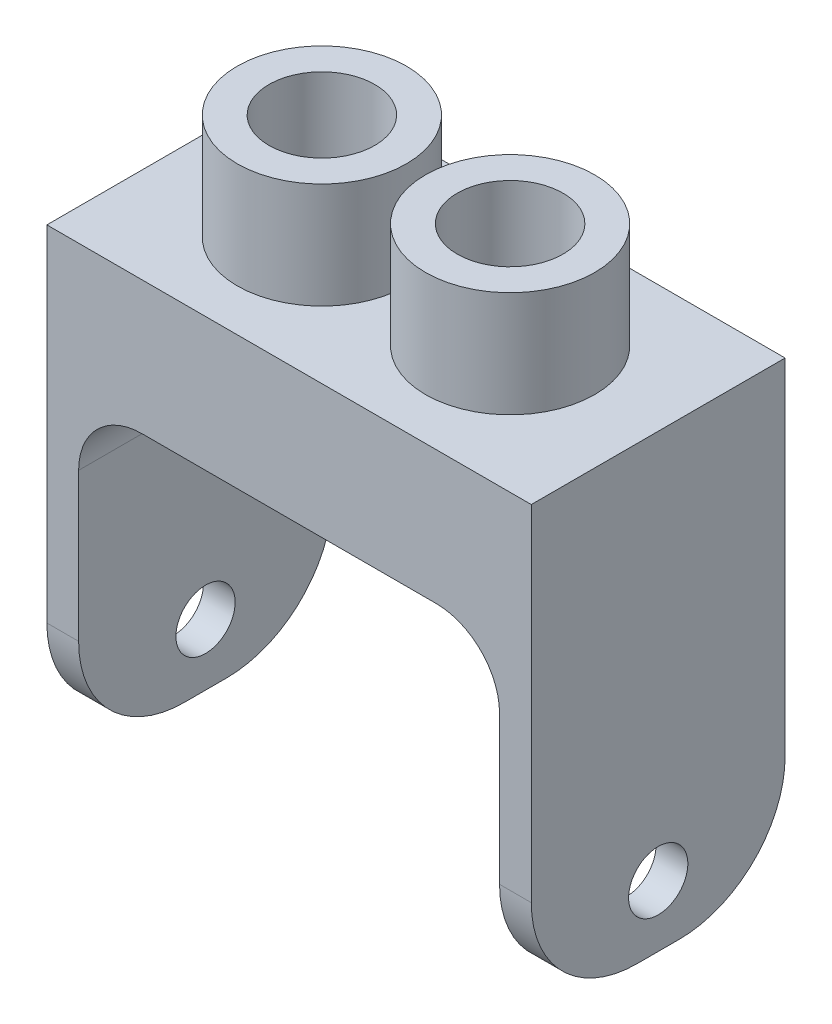
ISO-10303-21;
HEADER;
FILE_DESCRIPTION(('STEP AP214'),'2;1');
FILE_NAME('part.step','',(''),(''),'','','');
FILE_SCHEMA(('AUTOMOTIVE_DESIGN { 1 0 10303 214 1 1 1 1 }'));
ENDSEC;
DATA;
#1=APPLICATION_CONTEXT('core data for automotive mechanical design processes');
#2=APPLICATION_PROTOCOL_DEFINITION('international standard','automotive_design',2000,#1);
#3=PRODUCT_CONTEXT('',#1,'mechanical');
#4=PRODUCT('Part','Part','',(#3));
#5=PRODUCT_RELATED_PRODUCT_CATEGORY('part','',(#4));
#6=PRODUCT_DEFINITION_FORMATION('','',#4);
#7=PRODUCT_DEFINITION_CONTEXT('part definition',#1,'design');
#8=PRODUCT_DEFINITION('design','',#6,#7);
#9=PRODUCT_DEFINITION_SHAPE('','',#8);
#10=(LENGTH_UNIT() NAMED_UNIT(*) SI_UNIT(.MILLI.,.METRE.));
#11=(NAMED_UNIT(*) PLANE_ANGLE_UNIT() SI_UNIT($,.RADIAN.));
#12=(NAMED_UNIT(*) SI_UNIT($,.STERADIAN.) SOLID_ANGLE_UNIT());
#13=UNCERTAINTY_MEASURE_WITH_UNIT(LENGTH_MEASURE(1.E-05),#10,'distance_accuracy_value','');
#14=(GEOMETRIC_REPRESENTATION_CONTEXT(3) GLOBAL_UNCERTAINTY_ASSIGNED_CONTEXT((#13)) GLOBAL_UNIT_ASSIGNED_CONTEXT((#10,
#11,#12)) REPRESENTATION_CONTEXT('',''));
#15=CARTESIAN_POINT('',(0.,0.,0.));
#16=DIRECTION('',(0.,0.,1.));
#17=DIRECTION('',(1.,0.,0.));
#18=AXIS2_PLACEMENT_3D('',#15,#16,#17);
#19=CARTESIAN_POINT('',(0.,0.,0.));
#20=DIRECTION('',(0.,-1.,0.));
#21=DIRECTION('',(0.,0.,-1.));
#22=AXIS2_PLACEMENT_3D('',#19,#20,#21);
#23=PLANE('',#22);
#24=DIRECTION('',(-1.,0.,0.));
#25=VECTOR('',#24,1.);
#26=CARTESIAN_POINT('',(-11.45,0.,-6.));
#27=LINE('',#26,#25);
#28=CARTESIAN_POINT('',(6.95,0.,-6.));
#29=VERTEX_POINT('',#28);
#30=CARTESIAN_POINT('',(-6.95,0.,-6.));
#31=VERTEX_POINT('',#30);
#32=EDGE_CURVE('E269',#29,#31,#27,.T.);
#33=ORIENTED_EDGE('',*,*,#32,.F.);
#34=DIRECTION('',(0.,0.,-1.));
#35=VECTOR('',#34,1.);
#36=CARTESIAN_POINT('',(6.95,0.,0.));
#37=LINE('',#36,#35);
#38=CARTESIAN_POINT('',(6.95,0.,0.));
#39=VERTEX_POINT('',#38);
#40=EDGE_CURVE('E287',#29,#39,#37,.F.);
#41=ORIENTED_EDGE('',*,*,#40,.T.);
#42=CARTESIAN_POINT('',(4.45,0.,0.));
#43=DIRECTION('',(0.,-1.,0.));
#44=DIRECTION('',(0.,0.,-1.));
#45=AXIS2_PLACEMENT_3D('',#42,#43,#44);
#46=CIRCLE('',#45,2.5);
#47=EDGE_CURVE('E255',#39,#39,#46,.F.);
#48=ORIENTED_EDGE('',*,*,#47,.T.);
#49=DIRECTION('',(0.,0.,-1.));
#50=VECTOR('',#49,1.);
#51=CARTESIAN_POINT('',(6.95,0.,0.));
#52=LINE('',#51,#50);
#53=CARTESIAN_POINT('',(6.95,0.,6.));
#54=VERTEX_POINT('',#53);
#55=EDGE_CURVE('E285',#39,#54,#52,.F.);
#56=ORIENTED_EDGE('',*,*,#55,.T.);
#57=DIRECTION('',(1.,0.,0.));
#58=VECTOR('',#57,1.);
#59=CARTESIAN_POINT('',(-11.45,0.,6.));
#60=LINE('',#59,#58);
#61=CARTESIAN_POINT('',(-6.95,0.,6.));
#62=VERTEX_POINT('',#61);
#63=EDGE_CURVE('E164',#62,#54,#60,.T.);
#64=ORIENTED_EDGE('',*,*,#63,.F.);
#65=DIRECTION('',(0.,0.,1.));
#66=VECTOR('',#65,1.);
#67=CARTESIAN_POINT('',(-6.95,0.,0.));
#68=LINE('',#67,#66);
#69=CARTESIAN_POINT('',(-6.95,0.,0.));
#70=VERTEX_POINT('',#69);
#71=EDGE_CURVE('E283',#62,#70,#68,.F.);
#72=ORIENTED_EDGE('',*,*,#71,.T.);
#73=CARTESIAN_POINT('',(-4.45,0.,0.));
#74=DIRECTION('',(0.,-1.,0.));
#75=DIRECTION('',(0.,0.,-1.));
#76=AXIS2_PLACEMENT_3D('',#73,#74,#75);
#77=CIRCLE('',#76,2.5);
#78=EDGE_CURVE('E261',#70,#70,#77,.F.);
#79=ORIENTED_EDGE('',*,*,#78,.T.);
#80=DIRECTION('',(0.,0.,1.));
#81=VECTOR('',#80,1.);
#82=CARTESIAN_POINT('',(-6.95,0.,0.));
#83=LINE('',#82,#81);
#84=EDGE_CURVE('E281',#70,#31,#83,.F.);
#85=ORIENTED_EDGE('',*,*,#84,.T.);
#86=EDGE_LOOP('',(#33,#41,#48,#56,#64,#72,#79,#85));
#87=FACE_BOUND('',#86,.T.);
#88=ADVANCED_FACE('F35',(#87),#23,.T.);
#89=CARTESIAN_POINT('',(0.,6.3,0.));
#90=DIRECTION('',(0.,-1.,0.));
#91=DIRECTION('',(0.,0.,-1.));
#92=AXIS2_PLACEMENT_3D('',#89,#90,#91);
#93=PLANE('',#92);
#94=CARTESIAN_POINT('',(-4.45,6.3,0.));
#95=DIRECTION('',(0.,-1.,0.));
#96=DIRECTION('',(0.,0.,-1.));
#97=AXIS2_PLACEMENT_3D('',#94,#95,#96);
#98=CIRCLE('',#97,4.);
#99=CARTESIAN_POINT('',(-4.45,6.3,-4.));
#100=VERTEX_POINT('',#99);
#101=EDGE_CURVE('E169',#100,#100,#98,.F.);
#102=ORIENTED_EDGE('',*,*,#101,.F.);
#103=EDGE_LOOP('',(#102));
#104=FACE_BOUND('',#103,.T.);
#105=DIRECTION('',(0.,0.,-1.));
#106=VECTOR('',#105,1.);
#107=CARTESIAN_POINT('',(11.45,6.3,6.));
#108=LINE('',#107,#106);
#109=CARTESIAN_POINT('',(11.45,6.3,6.));
#110=VERTEX_POINT('',#109);
#111=CARTESIAN_POINT('',(11.45,6.3,-6.));
#112=VERTEX_POINT('',#111);
#113=EDGE_CURVE('E154',#110,#112,#108,.T.);
#114=ORIENTED_EDGE('',*,*,#113,.T.);
#115=DIRECTION('',(-1.,0.,0.));
#116=VECTOR('',#115,1.);
#117=CARTESIAN_POINT('',(-11.45,6.3,-6.));
#118=LINE('',#117,#116);
#119=CARTESIAN_POINT('',(-11.45,6.3,-6.));
#120=VERTEX_POINT('',#119);
#121=EDGE_CURVE('E142',#112,#120,#118,.T.);
#122=ORIENTED_EDGE('',*,*,#121,.T.);
#123=DIRECTION('',(0.,0.,1.));
#124=VECTOR('',#123,1.);
#125=CARTESIAN_POINT('',(-11.45,6.3,6.));
#126=LINE('',#125,#124);
#127=CARTESIAN_POINT('',(-11.45,6.3,6.));
#128=VERTEX_POINT('',#127);
#129=EDGE_CURVE('E153',#120,#128,#126,.T.);
#130=ORIENTED_EDGE('',*,*,#129,.T.);
#131=DIRECTION('',(1.,0.,0.));
#132=VECTOR('',#131,1.);
#133=CARTESIAN_POINT('',(-11.45,6.3,6.));
#134=LINE('',#133,#132);
#135=EDGE_CURVE('E160',#128,#110,#134,.T.);
#136=ORIENTED_EDGE('',*,*,#135,.T.);
#137=EDGE_LOOP('',(#114,#122,#130,#136));
#138=FACE_BOUND('',#137,.T.);
#139=CARTESIAN_POINT('',(4.45,6.3,0.));
#140=DIRECTION('',(0.,-1.,0.));
#141=DIRECTION('',(0.,0.,-1.));
#142=AXIS2_PLACEMENT_3D('',#139,#140,#141);
#143=CIRCLE('',#142,4.);
#144=CARTESIAN_POINT('',(4.45,6.3,-4.));
#145=VERTEX_POINT('',#144);
#146=EDGE_CURVE('E172',#145,#145,#143,.F.);
#147=ORIENTED_EDGE('',*,*,#146,.F.);
#148=EDGE_LOOP('',(#147));
#149=FACE_BOUND('',#148,.T.);
#150=ADVANCED_FACE('F157',(#104,#138,#149),#93,.F.);
#151=CARTESIAN_POINT('',(11.45,6.3,6.));
#152=DIRECTION('',(-1.,0.,0.));
#153=DIRECTION('',(0.,0.,1.));
#154=AXIS2_PLACEMENT_3D('',#151,#152,#153);
#155=PLANE('',#154);
#156=CARTESIAN_POINT('',(11.45,-12.1,0.));
#157=DIRECTION('',(-1.,0.,0.));
#158=DIRECTION('',(0.,0.,1.));
#159=AXIS2_PLACEMENT_3D('',#156,#157,#158);
#160=CIRCLE('',#159,1.4);
#161=CARTESIAN_POINT('',(11.45,-12.1,1.4));
#162=VERTEX_POINT('',#161);
#163=EDGE_CURVE('E303',#162,#162,#160,.F.);
#164=ORIENTED_EDGE('',*,*,#163,.F.);
#165=EDGE_LOOP('',(#164));
#166=FACE_BOUND('',#165,.T.);
#167=DIRECTION('',(0.,0.,1.));
#168=VECTOR('',#167,1.);
#169=CARTESIAN_POINT('',(11.45,-15.,6.));
#170=LINE('',#169,#168);
#171=CARTESIAN_POINT('',(11.45,-15.,-1.));
#172=VERTEX_POINT('',#171);
#173=CARTESIAN_POINT('',(11.45,-15.,1.));
#174=VERTEX_POINT('',#173);
#175=EDGE_CURVE('E234',#172,#174,#170,.T.);
#176=ORIENTED_EDGE('',*,*,#175,.F.);
#177=CARTESIAN_POINT('',(11.45,-10.,-1.));
#178=DIRECTION('',(-1.,0.,0.));
#179=DIRECTION('',(0.,0.,1.));
#180=AXIS2_PLACEMENT_3D('',#177,#178,#179);
#181=CIRCLE('',#180,5.);
#182=CARTESIAN_POINT('',(11.45,-10.,-6.));
#183=VERTEX_POINT('',#182);
#184=EDGE_CURVE('E168',#172,#183,#181,.F.);
#185=ORIENTED_EDGE('',*,*,#184,.T.);
#186=DIRECTION('',(0.,-1.,0.));
#187=VECTOR('',#186,1.);
#188=CARTESIAN_POINT('',(11.45,6.3,-6.));
#189=LINE('',#188,#187);
#190=EDGE_CURVE('E147',#112,#183,#189,.T.);
#191=ORIENTED_EDGE('',*,*,#190,.F.);
#192=ORIENTED_EDGE('',*,*,#113,.F.);
#193=DIRECTION('',(0.,-1.,0.));
#194=VECTOR('',#193,1.);
#195=CARTESIAN_POINT('',(11.45,6.3,6.));
#196=LINE('',#195,#194);
#197=CARTESIAN_POINT('',(11.45,-10.,6.));
#198=VERTEX_POINT('',#197);
#199=EDGE_CURVE('E235',#110,#198,#196,.T.);
#200=ORIENTED_EDGE('',*,*,#199,.T.);
#201=CARTESIAN_POINT('',(11.45,-10.,1.));
#202=DIRECTION('',(-1.,0.,0.));
#203=DIRECTION('',(0.,0.,1.));
#204=AXIS2_PLACEMENT_3D('',#201,#202,#203);
#205=CIRCLE('',#204,5.);
#206=EDGE_CURVE('E214',#198,#174,#205,.F.);
#207=ORIENTED_EDGE('',*,*,#206,.T.);
#208=EDGE_LOOP('',(#176,#185,#191,#192,#200,#207));
#209=FACE_BOUND('',#208,.T.);
#210=ADVANCED_FACE('F167',(#166,#209),#155,.F.);
#211=CARTESIAN_POINT('',(-11.45,6.3,-6.));
#212=DIRECTION('',(0.,0.,1.));
#213=DIRECTION('',(1.,0.,0.));
#214=AXIS2_PLACEMENT_3D('',#211,#212,#213);
#215=PLANE('',#214);
#216=DIRECTION('',(0.,1.,0.));
#217=VECTOR('',#216,1.);
#218=CARTESIAN_POINT('',(-9.95,-15.,-6.));
#219=LINE('',#218,#217);
#220=CARTESIAN_POINT('',(-9.95,-10.,-6.));
#221=VERTEX_POINT('',#220);
#222=CARTESIAN_POINT('',(-9.95,-3.,-6.));
#223=VERTEX_POINT('',#222);
#224=EDGE_CURVE('E189',#221,#223,#219,.T.);
#225=ORIENTED_EDGE('',*,*,#224,.F.);
#226=DIRECTION('',(1.,0.,0.));
#227=VECTOR('',#226,1.);
#228=CARTESIAN_POINT('',(-11.45,-10.,-6.));
#229=LINE('',#228,#227);
#230=CARTESIAN_POINT('',(-11.45,-10.,-6.));
#231=VERTEX_POINT('',#230);
#232=EDGE_CURVE('E199',#221,#231,#229,.F.);
#233=ORIENTED_EDGE('',*,*,#232,.T.);
#234=DIRECTION('',(0.,-1.,0.));
#235=VECTOR('',#234,1.);
#236=CARTESIAN_POINT('',(-11.45,6.3,-6.));
#237=LINE('',#236,#235);
#238=EDGE_CURVE('E150',#120,#231,#237,.T.);
#239=ORIENTED_EDGE('',*,*,#238,.F.);
#240=ORIENTED_EDGE('',*,*,#121,.F.);
#241=ORIENTED_EDGE('',*,*,#190,.T.);
#242=DIRECTION('',(1.,0.,0.));
#243=VECTOR('',#242,1.);
#244=CARTESIAN_POINT('',(-11.45,-10.,-6.));
#245=LINE('',#244,#243);
#246=CARTESIAN_POINT('',(9.95,-10.,-6.));
#247=VERTEX_POINT('',#246);
#248=EDGE_CURVE('E197',#183,#247,#245,.F.);
#249=ORIENTED_EDGE('',*,*,#248,.T.);
#250=DIRECTION('',(0.,1.,0.));
#251=VECTOR('',#250,1.);
#252=CARTESIAN_POINT('',(9.95,-15.,-6.));
#253=LINE('',#252,#251);
#254=CARTESIAN_POINT('',(9.95,-3.,-6.));
#255=VERTEX_POINT('',#254);
#256=EDGE_CURVE('E230',#247,#255,#253,.T.);
#257=ORIENTED_EDGE('',*,*,#256,.T.);
#258=CARTESIAN_POINT('',(6.95,-3.,-6.));
#259=DIRECTION('',(0.,0.,1.));
#260=DIRECTION('',(1.,0.,0.));
#261=AXIS2_PLACEMENT_3D('',#258,#259,#260);
#262=CIRCLE('',#261,3.);
#263=EDGE_CURVE('E292',#255,#29,#262,.T.);
#264=ORIENTED_EDGE('',*,*,#263,.T.);
#265=ORIENTED_EDGE('',*,*,#32,.T.);
#266=CARTESIAN_POINT('',(-6.95,-3.,-6.));
#267=DIRECTION('',(0.,0.,1.));
#268=DIRECTION('',(1.,0.,0.));
#269=AXIS2_PLACEMENT_3D('',#266,#267,#268);
#270=CIRCLE('',#269,3.);
#271=EDGE_CURVE('E297',#31,#223,#270,.T.);
#272=ORIENTED_EDGE('',*,*,#271,.T.);
#273=EDGE_LOOP('',(#225,#233,#239,#240,#241,#249,#257,#264,#265,#272));
#274=FACE_BOUND('',#273,.T.);
#275=ADVANCED_FACE('F145',(#274),#215,.F.);
#276=CARTESIAN_POINT('',(-11.45,6.3,6.));
#277=DIRECTION('',(1.,0.,0.));
#278=DIRECTION('',(0.,0.,-1.));
#279=AXIS2_PLACEMENT_3D('',#276,#277,#278);
#280=PLANE('',#279);
#281=CARTESIAN_POINT('',(-11.45,-12.1,0.));
#282=DIRECTION('',(-1.,0.,0.));
#283=DIRECTION('',(0.,0.,1.));
#284=AXIS2_PLACEMENT_3D('',#281,#282,#283);
#285=CIRCLE('',#284,1.4);
#286=CARTESIAN_POINT('',(-11.45,-12.1,1.4));
#287=VERTEX_POINT('',#286);
#288=EDGE_CURVE('E591',#287,#287,#285,.T.);
#289=ORIENTED_EDGE('',*,*,#288,.F.);
#290=EDGE_LOOP('',(#289));
#291=FACE_BOUND('',#290,.T.);
#292=ORIENTED_EDGE('',*,*,#238,.T.);
#293=CARTESIAN_POINT('',(-11.45,-10.,-1.));
#294=DIRECTION('',(1.,0.,0.));
#295=DIRECTION('',(0.,0.,-1.));
#296=AXIS2_PLACEMENT_3D('',#293,#294,#295);
#297=CIRCLE('',#296,5.);
#298=CARTESIAN_POINT('',(-11.45,-15.,-1.));
#299=VERTEX_POINT('',#298);
#300=EDGE_CURVE('E203',#231,#299,#297,.F.);
#301=ORIENTED_EDGE('',*,*,#300,.T.);
#302=DIRECTION('',(0.,0.,-1.));
#303=VECTOR('',#302,1.);
#304=CARTESIAN_POINT('',(-11.45,-15.,6.));
#305=LINE('',#304,#303);
#306=CARTESIAN_POINT('',(-11.45,-15.,1.));
#307=VERTEX_POINT('',#306);
#308=EDGE_CURVE('E229',#307,#299,#305,.T.);
#309=ORIENTED_EDGE('',*,*,#308,.F.);
#310=CARTESIAN_POINT('',(-11.45,-10.,1.));
#311=DIRECTION('',(1.,0.,0.));
#312=DIRECTION('',(0.,0.,-1.));
#313=AXIS2_PLACEMENT_3D('',#310,#311,#312);
#314=CIRCLE('',#313,5.);
#315=CARTESIAN_POINT('',(-11.45,-10.,6.));
#316=VERTEX_POINT('',#315);
#317=EDGE_CURVE('E201',#307,#316,#314,.F.);
#318=ORIENTED_EDGE('',*,*,#317,.T.);
#319=DIRECTION('',(0.,-1.,0.));
#320=VECTOR('',#319,1.);
#321=CARTESIAN_POINT('',(-11.45,6.3,6.));
#322=LINE('',#321,#320);
#323=EDGE_CURVE('E174',#128,#316,#322,.T.);
#324=ORIENTED_EDGE('',*,*,#323,.F.);
#325=ORIENTED_EDGE('',*,*,#129,.F.);
#326=EDGE_LOOP('',(#292,#301,#309,#318,#324,#325));
#327=FACE_BOUND('',#326,.T.);
#328=ADVANCED_FACE('F322',(#291,#327),#280,.F.);
#329=CARTESIAN_POINT('',(-11.45,6.3,6.));
#330=DIRECTION('',(0.,0.,-1.));
#331=DIRECTION('',(-1.,0.,0.));
#332=AXIS2_PLACEMENT_3D('',#329,#330,#331);
#333=PLANE('',#332);
#334=ORIENTED_EDGE('',*,*,#323,.T.);
#335=DIRECTION('',(-1.,0.,0.));
#336=VECTOR('',#335,1.);
#337=CARTESIAN_POINT('',(-9.95,-10.,6.));
#338=LINE('',#337,#336);
#339=CARTESIAN_POINT('',(-9.95,-10.,6.));
#340=VERTEX_POINT('',#339);
#341=EDGE_CURVE('E207',#316,#340,#338,.F.);
#342=ORIENTED_EDGE('',*,*,#341,.T.);
#343=DIRECTION('',(0.,1.,0.));
#344=VECTOR('',#343,1.);
#345=CARTESIAN_POINT('',(-9.95,-15.,6.));
#346=LINE('',#345,#344);
#347=CARTESIAN_POINT('',(-9.95,-3.,6.));
#348=VERTEX_POINT('',#347);
#349=EDGE_CURVE('E186',#340,#348,#346,.T.);
#350=ORIENTED_EDGE('',*,*,#349,.T.);
#351=CARTESIAN_POINT('',(-6.95,-3.,6.));
#352=DIRECTION('',(0.,0.,-1.));
#353=DIRECTION('',(-1.,0.,0.));
#354=AXIS2_PLACEMENT_3D('',#351,#352,#353);
#355=CIRCLE('',#354,3.);
#356=EDGE_CURVE('E295',#348,#62,#355,.T.);
#357=ORIENTED_EDGE('',*,*,#356,.T.);
#358=ORIENTED_EDGE('',*,*,#63,.T.);
#359=CARTESIAN_POINT('',(6.95,-3.,6.));
#360=DIRECTION('',(0.,0.,-1.));
#361=DIRECTION('',(-1.,0.,0.));
#362=AXIS2_PLACEMENT_3D('',#359,#360,#361);
#363=CIRCLE('',#362,3.);
#364=CARTESIAN_POINT('',(9.95,-3.,6.));
#365=VERTEX_POINT('',#364);
#366=EDGE_CURVE('E227',#54,#365,#363,.T.);
#367=ORIENTED_EDGE('',*,*,#366,.T.);
#368=DIRECTION('',(0.,1.,0.));
#369=VECTOR('',#368,1.);
#370=CARTESIAN_POINT('',(9.95,-15.,6.));
#371=LINE('',#370,#369);
#372=CARTESIAN_POINT('',(9.95,-10.,6.));
#373=VERTEX_POINT('',#372);
#374=EDGE_CURVE('E219',#373,#365,#371,.T.);
#375=ORIENTED_EDGE('',*,*,#374,.F.);
#376=DIRECTION('',(-1.,0.,0.));
#377=VECTOR('',#376,1.);
#378=CARTESIAN_POINT('',(-11.45,-10.,6.));
#379=LINE('',#378,#377);
#380=EDGE_CURVE('E205',#373,#198,#379,.F.);
#381=ORIENTED_EDGE('',*,*,#380,.T.);
#382=ORIENTED_EDGE('',*,*,#199,.F.);
#383=ORIENTED_EDGE('',*,*,#135,.F.);
#384=EDGE_LOOP('',(#334,#342,#350,#357,#358,#367,#375,#381,#382,#383));
#385=FACE_BOUND('',#384,.T.);
#386=ADVANCED_FACE('F224',(#385),#333,.F.);
#387=CARTESIAN_POINT('',(-4.45,11.3,0.));
#388=DIRECTION('',(0.,-1.,0.));
#389=DIRECTION('',(0.,0.,-1.));
#390=AXIS2_PLACEMENT_3D('',#387,#388,#389);
#391=CYLINDRICAL_SURFACE('',#390,4.);
#392=CARTESIAN_POINT('',(-4.45,11.3,0.));
#393=DIRECTION('',(0.,1.,0.));
#394=DIRECTION('',(0.,0.,1.));
#395=AXIS2_PLACEMENT_3D('',#392,#393,#394);
#396=CIRCLE('',#395,4.);
#397=CARTESIAN_POINT('',(-4.45,11.3,4.));
#398=VERTEX_POINT('',#397);
#399=EDGE_CURVE('E267',#398,#398,#396,.T.);
#400=ORIENTED_EDGE('',*,*,#399,.F.);
#401=EDGE_LOOP('',(#400));
#402=FACE_BOUND('',#401,.T.);
#403=ORIENTED_EDGE('',*,*,#101,.T.);
#404=EDGE_LOOP('',(#403));
#405=FACE_BOUND('',#404,.T.);
#406=ADVANCED_FACE('F361',(#402,#405),#391,.T.);
#407=CARTESIAN_POINT('',(-4.45,11.3,0.));
#408=DIRECTION('',(0.,1.,0.));
#409=DIRECTION('',(0.,0.,1.));
#410=AXIS2_PLACEMENT_3D('',#407,#408,#409);
#411=PLANE('',#410);
#412=CARTESIAN_POINT('',(-4.45,11.3,0.));
#413=DIRECTION('',(0.,1.,0.));
#414=DIRECTION('',(0.,0.,1.));
#415=AXIS2_PLACEMENT_3D('',#412,#413,#414);
#416=CIRCLE('',#415,2.5);
#417=CARTESIAN_POINT('',(-4.45,11.3,2.5));
#418=VERTEX_POINT('',#417);
#419=EDGE_CURVE('E258',#418,#418,#416,.T.);
#420=ORIENTED_EDGE('',*,*,#419,.F.);
#421=EDGE_LOOP('',(#420));
#422=FACE_BOUND('',#421,.T.);
#423=ORIENTED_EDGE('',*,*,#399,.T.);
#424=EDGE_LOOP('',(#423));
#425=FACE_BOUND('',#424,.T.);
#426=ADVANCED_FACE('F414',(#422,#425),#411,.T.);
#427=CARTESIAN_POINT('',(4.45,11.3,0.));
#428=DIRECTION('',(0.,-1.,0.));
#429=DIRECTION('',(0.,0.,-1.));
#430=AXIS2_PLACEMENT_3D('',#427,#428,#429);
#431=CYLINDRICAL_SURFACE('',#430,4.);
#432=CARTESIAN_POINT('',(4.45,11.3,0.));
#433=DIRECTION('',(0.,1.,0.));
#434=DIRECTION('',(0.,0.,1.));
#435=AXIS2_PLACEMENT_3D('',#432,#433,#434);
#436=CIRCLE('',#435,4.);
#437=CARTESIAN_POINT('',(4.45,11.3,4.));
#438=VERTEX_POINT('',#437);
#439=EDGE_CURVE('E264',#438,#438,#436,.T.);
#440=ORIENTED_EDGE('',*,*,#439,.F.);
#441=EDGE_LOOP('',(#440));
#442=FACE_BOUND('',#441,.T.);
#443=ORIENTED_EDGE('',*,*,#146,.T.);
#444=EDGE_LOOP('',(#443));
#445=FACE_BOUND('',#444,.T.);
#446=ADVANCED_FACE('F410',(#442,#445),#431,.T.);
#447=CARTESIAN_POINT('',(4.45,11.3,0.));
#448=DIRECTION('',(0.,1.,0.));
#449=DIRECTION('',(0.,0.,1.));
#450=AXIS2_PLACEMENT_3D('',#447,#448,#449);
#451=PLANE('',#450);
#452=CARTESIAN_POINT('',(4.45,11.3,0.));
#453=DIRECTION('',(0.,1.,0.));
#454=DIRECTION('',(0.,0.,1.));
#455=AXIS2_PLACEMENT_3D('',#452,#453,#454);
#456=CIRCLE('',#455,2.5);
#457=CARTESIAN_POINT('',(4.45,11.3,2.5));
#458=VERTEX_POINT('',#457);
#459=EDGE_CURVE('E252',#458,#458,#456,.T.);
#460=ORIENTED_EDGE('',*,*,#459,.F.);
#461=EDGE_LOOP('',(#460));
#462=FACE_BOUND('',#461,.T.);
#463=ORIENTED_EDGE('',*,*,#439,.T.);
#464=EDGE_LOOP('',(#463));
#465=FACE_BOUND('',#464,.T.);
#466=ADVANCED_FACE('F406',(#462,#465),#451,.T.);
#467=CARTESIAN_POINT('',(-4.45,-7.07106781186548,0.));
#468=DIRECTION('',(0.,1.,0.));
#469=DIRECTION('',(0.,0.,1.));
#470=AXIS2_PLACEMENT_3D('',#467,#468,#469);
#471=CYLINDRICAL_SURFACE('',#470,2.5);
#472=ORIENTED_EDGE('',*,*,#419,.T.);
#473=EDGE_LOOP('',(#472));
#474=FACE_BOUND('',#473,.T.);
#475=ORIENTED_EDGE('',*,*,#78,.F.);
#476=EDGE_LOOP('',(#475));
#477=FACE_BOUND('',#476,.T.);
#478=ADVANCED_FACE('F402',(#474,#477),#471,.F.);
#479=CARTESIAN_POINT('',(4.45,-7.07106781186548,0.));
#480=DIRECTION('',(0.,1.,0.));
#481=DIRECTION('',(0.,0.,1.));
#482=AXIS2_PLACEMENT_3D('',#479,#480,#481);
#483=CYLINDRICAL_SURFACE('',#482,2.5);
#484=ORIENTED_EDGE('',*,*,#459,.T.);
#485=EDGE_LOOP('',(#484));
#486=FACE_BOUND('',#485,.T.);
#487=ORIENTED_EDGE('',*,*,#47,.F.);
#488=EDGE_LOOP('',(#487));
#489=FACE_BOUND('',#488,.T.);
#490=ADVANCED_FACE('F398',(#486,#489),#483,.F.);
#491=CARTESIAN_POINT('',(-9.95,-15.,6.));
#492=DIRECTION('',(-1.,0.,0.));
#493=DIRECTION('',(0.,0.,1.));
#494=AXIS2_PLACEMENT_3D('',#491,#492,#493);
#495=PLANE('',#494);
#496=CARTESIAN_POINT('',(-9.95,-12.1,0.));
#497=DIRECTION('',(-1.,0.,0.));
#498=DIRECTION('',(0.,0.,1.));
#499=AXIS2_PLACEMENT_3D('',#496,#497,#498);
#500=CIRCLE('',#499,1.4);
#501=CARTESIAN_POINT('',(-9.95,-12.1,1.4));
#502=VERTEX_POINT('',#501);
#503=EDGE_CURVE('E239',#502,#502,#500,.T.);
#504=ORIENTED_EDGE('',*,*,#503,.T.);
#505=EDGE_LOOP('',(#504));
#506=FACE_BOUND('',#505,.T.);
#507=DIRECTION('',(0.,0.,1.));
#508=VECTOR('',#507,1.);
#509=CARTESIAN_POINT('',(-9.95,-15.,6.));
#510=LINE('',#509,#508);
#511=CARTESIAN_POINT('',(-9.95,-15.,-1.));
#512=VERTEX_POINT('',#511);
#513=CARTESIAN_POINT('',(-9.95,-15.,1.));
#514=VERTEX_POINT('',#513);
#515=EDGE_CURVE('E190',#512,#514,#510,.T.);
#516=ORIENTED_EDGE('',*,*,#515,.F.);
#517=CARTESIAN_POINT('',(-9.95,-10.,-1.));
#518=DIRECTION('',(-1.,0.,0.));
#519=DIRECTION('',(0.,0.,1.));
#520=AXIS2_PLACEMENT_3D('',#517,#518,#519);
#521=CIRCLE('',#520,5.);
#522=EDGE_CURVE('E194',#512,#221,#521,.F.);
#523=ORIENTED_EDGE('',*,*,#522,.T.);
#524=ORIENTED_EDGE('',*,*,#224,.T.);
#525=DIRECTION('',(0.,0.,1.));
#526=VECTOR('',#525,1.);
#527=CARTESIAN_POINT('',(-9.95,-3.,6.));
#528=LINE('',#527,#526);
#529=EDGE_CURVE('E289',#223,#348,#528,.T.);
#530=ORIENTED_EDGE('',*,*,#529,.T.);
#531=ORIENTED_EDGE('',*,*,#349,.F.);
#532=CARTESIAN_POINT('',(-9.95,-10.,1.));
#533=DIRECTION('',(-1.,0.,0.));
#534=DIRECTION('',(0.,0.,1.));
#535=AXIS2_PLACEMENT_3D('',#532,#533,#534);
#536=CIRCLE('',#535,5.);
#537=EDGE_CURVE('E192',#340,#514,#536,.F.);
#538=ORIENTED_EDGE('',*,*,#537,.T.);
#539=EDGE_LOOP('',(#516,#523,#524,#530,#531,#538));
#540=FACE_BOUND('',#539,.T.);
#541=ADVANCED_FACE('F315',(#506,#540),#495,.F.);
#542=CARTESIAN_POINT('',(0.,-15.,0.));
#543=DIRECTION('',(0.,-1.,0.));
#544=DIRECTION('',(0.,0.,-1.));
#545=AXIS2_PLACEMENT_3D('',#542,#543,#544);
#546=PLANE('',#545);
#547=ORIENTED_EDGE('',*,*,#308,.T.);
#548=DIRECTION('',(1.,0.,0.));
#549=VECTOR('',#548,1.);
#550=CARTESIAN_POINT('',(-9.95,-15.,-1.));
#551=LINE('',#550,#549);
#552=EDGE_CURVE('E195',#299,#512,#551,.T.);
#553=ORIENTED_EDGE('',*,*,#552,.T.);
#554=ORIENTED_EDGE('',*,*,#515,.T.);
#555=DIRECTION('',(-1.,0.,0.));
#556=VECTOR('',#555,1.);
#557=CARTESIAN_POINT('',(-11.45,-15.,1.));
#558=LINE('',#557,#556);
#559=EDGE_CURVE('E300',#514,#307,#558,.T.);
#560=ORIENTED_EDGE('',*,*,#559,.T.);
#561=EDGE_LOOP('',(#547,#553,#554,#560));
#562=FACE_BOUND('',#561,.T.);
#563=ADVANCED_FACE('F309',(#562),#546,.T.);
#564=CARTESIAN_POINT('',(9.95,-15.,6.));
#565=DIRECTION('',(1.,0.,0.));
#566=DIRECTION('',(0.,0.,-1.));
#567=AXIS2_PLACEMENT_3D('',#564,#565,#566);
#568=PLANE('',#567);
#569=CARTESIAN_POINT('',(9.95,-12.1,0.));
#570=DIRECTION('',(1.,0.,0.));
#571=DIRECTION('',(0.,0.,-1.));
#572=AXIS2_PLACEMENT_3D('',#569,#570,#571);
#573=CIRCLE('',#572,1.4);
#574=CARTESIAN_POINT('',(9.95,-12.1,1.4));
#575=VERTEX_POINT('',#574);
#576=EDGE_CURVE('E243',#575,#575,#573,.T.);
#577=ORIENTED_EDGE('',*,*,#576,.T.);
#578=EDGE_LOOP('',(#577));
#579=FACE_BOUND('',#578,.T.);
#580=ORIENTED_EDGE('',*,*,#256,.F.);
#581=CARTESIAN_POINT('',(9.95,-10.,-1.));
#582=DIRECTION('',(1.,0.,0.));
#583=DIRECTION('',(0.,0.,-1.));
#584=AXIS2_PLACEMENT_3D('',#581,#582,#583);
#585=CIRCLE('',#584,5.);
#586=CARTESIAN_POINT('',(9.95,-15.,-1.));
#587=VERTEX_POINT('',#586);
#588=EDGE_CURVE('E11',#247,#587,#585,.F.);
#589=ORIENTED_EDGE('',*,*,#588,.T.);
#590=DIRECTION('',(0.,0.,-1.));
#591=VECTOR('',#590,1.);
#592=CARTESIAN_POINT('',(9.95,-15.,6.));
#593=LINE('',#592,#591);
#594=CARTESIAN_POINT('',(9.95,-15.,1.));
#595=VERTEX_POINT('',#594);
#596=EDGE_CURVE('E221',#595,#587,#593,.T.);
#597=ORIENTED_EDGE('',*,*,#596,.F.);
#598=CARTESIAN_POINT('',(9.95,-10.,1.));
#599=DIRECTION('',(1.,0.,0.));
#600=DIRECTION('',(0.,0.,-1.));
#601=AXIS2_PLACEMENT_3D('',#598,#599,#600);
#602=CIRCLE('',#601,5.);
#603=EDGE_CURVE('E43',#595,#373,#602,.F.);
#604=ORIENTED_EDGE('',*,*,#603,.T.);
#605=ORIENTED_EDGE('',*,*,#374,.T.);
#606=DIRECTION('',(0.,0.,-1.));
#607=VECTOR('',#606,1.);
#608=CARTESIAN_POINT('',(9.95,-3.,6.));
#609=LINE('',#608,#607);
#610=EDGE_CURVE('E180',#365,#255,#609,.T.);
#611=ORIENTED_EDGE('',*,*,#610,.T.);
#612=EDGE_LOOP('',(#580,#589,#597,#604,#605,#611));
#613=FACE_BOUND('',#612,.T.);
#614=ADVANCED_FACE('F217',(#579,#613),#568,.F.);
#615=CARTESIAN_POINT('',(0.,-15.,0.));
#616=DIRECTION('',(0.,1.,0.));
#617=DIRECTION('',(0.,0.,1.));
#618=AXIS2_PLACEMENT_3D('',#615,#616,#617);
#619=PLANE('',#618);
#620=ORIENTED_EDGE('',*,*,#596,.T.);
#621=DIRECTION('',(1.,0.,0.));
#622=VECTOR('',#621,1.);
#623=CARTESIAN_POINT('',(0.,-15.,-1.));
#624=LINE('',#623,#622);
#625=EDGE_CURVE('E211',#587,#172,#624,.T.);
#626=ORIENTED_EDGE('',*,*,#625,.T.);
#627=ORIENTED_EDGE('',*,*,#175,.T.);
#628=DIRECTION('',(-1.,0.,0.));
#629=VECTOR('',#628,1.);
#630=CARTESIAN_POINT('',(0.,-15.,1.));
#631=LINE('',#630,#629);
#632=EDGE_CURVE('E209',#174,#595,#631,.T.);
#633=ORIENTED_EDGE('',*,*,#632,.T.);
#634=EDGE_LOOP('',(#620,#626,#627,#633));
#635=FACE_BOUND('',#634,.T.);
#636=ADVANCED_FACE('F237',(#635),#619,.F.);
#637=CARTESIAN_POINT('',(6.95,-3.,6.));
#638=DIRECTION('',(0.,0.,-1.));
#639=DIRECTION('',(-1.,0.,0.));
#640=AXIS2_PLACEMENT_3D('',#637,#638,#639);
#641=CYLINDRICAL_SURFACE('',#640,3.);
#642=ORIENTED_EDGE('',*,*,#55,.F.);
#643=ORIENTED_EDGE('',*,*,#40,.F.);
#644=ORIENTED_EDGE('',*,*,#263,.F.);
#645=ORIENTED_EDGE('',*,*,#610,.F.);
#646=ORIENTED_EDGE('',*,*,#366,.F.);
#647=EDGE_LOOP('',(#642,#643,#644,#645,#646));
#648=FACE_BOUND('',#647,.T.);
#649=ADVANCED_FACE('F340',(#648),#641,.F.);
#650=CARTESIAN_POINT('',(-6.95,-3.,6.));
#651=DIRECTION('',(0.,0.,1.));
#652=DIRECTION('',(1.,0.,0.));
#653=AXIS2_PLACEMENT_3D('',#650,#651,#652);
#654=CYLINDRICAL_SURFACE('',#653,3.);
#655=ORIENTED_EDGE('',*,*,#84,.F.);
#656=ORIENTED_EDGE('',*,*,#71,.F.);
#657=ORIENTED_EDGE('',*,*,#356,.F.);
#658=ORIENTED_EDGE('',*,*,#529,.F.);
#659=ORIENTED_EDGE('',*,*,#271,.F.);
#660=EDGE_LOOP('',(#655,#656,#657,#658,#659));
#661=FACE_BOUND('',#660,.T.);
#662=ADVANCED_FACE('F331',(#661),#654,.F.);
#663=CARTESIAN_POINT('',(15.4097979746447,-12.1,0.));
#664=DIRECTION('',(-1.,0.,0.));
#665=DIRECTION('',(0.,0.,1.));
#666=AXIS2_PLACEMENT_3D('',#663,#664,#665);
#667=CYLINDRICAL_SURFACE('',#666,1.4);
#668=CARTESIAN_POINT('',(11.45,-12.1,1.4));
#669=CARTESIAN_POINT('',(11.434375,-12.1,1.4));
#670=CARTESIAN_POINT('',(11.41875,-12.1,1.4));
#671=CARTESIAN_POINT('',(11.3875,-12.1,1.4));
#672=CARTESIAN_POINT('',(11.371875,-12.1,1.4));
#673=CARTESIAN_POINT('',(11.340625,-12.1,1.4));
#674=CARTESIAN_POINT('',(11.325,-12.1,1.4));
#675=CARTESIAN_POINT('',(11.29375,-12.1,1.4));
#676=CARTESIAN_POINT('',(11.278125,-12.1,1.4));
#677=CARTESIAN_POINT('',(11.246875,-12.1,1.4));
#678=CARTESIAN_POINT('',(11.23125,-12.1,1.4));
#679=CARTESIAN_POINT('',(11.2,-12.1,1.4));
#680=CARTESIAN_POINT('',(11.184375,-12.1,1.4));
#681=CARTESIAN_POINT('',(11.153125,-12.1,1.4));
#682=CARTESIAN_POINT('',(11.1375,-12.1,1.4));
#683=CARTESIAN_POINT('',(11.10625,-12.1,1.4));
#684=CARTESIAN_POINT('',(11.090625,-12.1,1.4));
#685=CARTESIAN_POINT('',(11.059375,-12.1,1.4));
#686=CARTESIAN_POINT('',(11.04375,-12.1,1.4));
#687=CARTESIAN_POINT('',(11.0125,-12.1,1.4));
#688=CARTESIAN_POINT('',(10.996875,-12.1,1.4));
#689=CARTESIAN_POINT('',(10.965625,-12.1,1.4));
#690=CARTESIAN_POINT('',(10.95,-12.1,1.4));
#691=CARTESIAN_POINT('',(10.91875,-12.1,1.4));
#692=CARTESIAN_POINT('',(10.903125,-12.1,1.4));
#693=CARTESIAN_POINT('',(10.871875,-12.1,1.4));
#694=CARTESIAN_POINT('',(10.85625,-12.1,1.4));
#695=CARTESIAN_POINT('',(10.825,-12.1,1.4));
#696=CARTESIAN_POINT('',(10.809375,-12.1,1.4));
#697=CARTESIAN_POINT('',(10.778125,-12.1,1.4));
#698=CARTESIAN_POINT('',(10.7625,-12.1,1.4));
#699=CARTESIAN_POINT('',(10.73125,-12.1,1.4));
#700=CARTESIAN_POINT('',(10.715625,-12.1,1.4));
#701=CARTESIAN_POINT('',(10.684375,-12.1,1.4));
#702=CARTESIAN_POINT('',(10.66875,-12.1,1.4));
#703=CARTESIAN_POINT('',(10.6375,-12.1,1.4));
#704=CARTESIAN_POINT('',(10.621875,-12.1,1.4));
#705=CARTESIAN_POINT('',(10.590625,-12.1,1.4));
#706=CARTESIAN_POINT('',(10.575,-12.1,1.4));
#707=CARTESIAN_POINT('',(10.54375,-12.1,1.4));
#708=CARTESIAN_POINT('',(10.528125,-12.1,1.4));
#709=CARTESIAN_POINT('',(10.496875,-12.1,1.4));
#710=CARTESIAN_POINT('',(10.48125,-12.1,1.4));
#711=CARTESIAN_POINT('',(10.45,-12.1,1.4));
#712=CARTESIAN_POINT('',(10.434375,-12.1,1.4));
#713=CARTESIAN_POINT('',(10.403125,-12.1,1.4));
#714=CARTESIAN_POINT('',(10.3875,-12.1,1.4));
#715=CARTESIAN_POINT('',(10.35625,-12.1,1.4));
#716=CARTESIAN_POINT('',(10.340625,-12.1,1.4));
#717=CARTESIAN_POINT('',(10.309375,-12.1,1.4));
#718=CARTESIAN_POINT('',(10.29375,-12.1,1.4));
#719=CARTESIAN_POINT('',(10.2625,-12.1,1.4));
#720=CARTESIAN_POINT('',(10.246875,-12.1,1.4));
#721=CARTESIAN_POINT('',(10.215625,-12.1,1.4));
#722=CARTESIAN_POINT('',(10.2,-12.1,1.4));
#723=CARTESIAN_POINT('',(10.16875,-12.1,1.4));
#724=CARTESIAN_POINT('',(10.153125,-12.1,1.4));
#725=CARTESIAN_POINT('',(10.121875,-12.1,1.4));
#726=CARTESIAN_POINT('',(10.10625,-12.1,1.4));
#727=CARTESIAN_POINT('',(10.075,-12.1,1.4));
#728=CARTESIAN_POINT('',(10.059375,-12.1,1.4));
#729=CARTESIAN_POINT('',(10.028125,-12.1,1.4));
#730=CARTESIAN_POINT('',(10.0125,-12.1,1.4));
#731=CARTESIAN_POINT('',(9.98125,-12.1,1.4));
#732=CARTESIAN_POINT('',(9.965625,-12.1,1.4));
#733=CARTESIAN_POINT('',(9.95,-12.1,1.4));
#734=B_SPLINE_CURVE_WITH_KNOTS('',3,(#668,#669,#670,#671,#672,#673,#674,#675,#676,#677,#678,
#679,#680,#681,#682,#683,#684,#685,#686,#687,#688,#689,#690,#691,#692,#693,#694,#695,#696,#697,
#698,#699,#700,#701,#702,#703,#704,#705,#706,#707,#708,#709,#710,#711,#712,#713,#714,#715,#716,
#717,#718,#719,#720,#721,#722,#723,#724,#725,#726,#727,#728,#729,#730,#731,#732,#733),
.UNSPECIFIED.,.F.,.F.,(4,2,2,2,2,2,2,2,2,2,2,2,2,2,2,2,2,2,2,2,2,2,2,2,2,2,2,2,2,2,2,2,4),(0.,
0.0468750000000018,0.0937500000000001,0.140625000000002,0.1875,0.234375000000002,0.28125,
0.328125000000002,0.375,0.421875,0.46875,0.515625,0.5625,0.609375000000001,0.656250000000001,
0.703125000000001,0.750000000000001,0.796875000000001,0.843750000000001,0.890625000000001,
0.937500000000001,0.984375000000001,1.03125,1.078125,1.125,1.171875,1.21875,1.265625,1.3125,
1.359375,1.40625,1.453125,1.5),.UNSPECIFIED.);
#735=EDGE_CURVE('BSEAM374',#162,#575,#734,.T.);
#736=ORIENTED_EDGE('',*,*,#163,.T.);
#737=ORIENTED_EDGE('',*,*,#576,.F.);
#738=ORIENTED_EDGE('',*,*,#735,.T.);
#739=ORIENTED_EDGE('',*,*,#735,.F.);
#740=EDGE_LOOP('',(#736,#738,#737,#739));
#741=FACE_BOUND('',#740,.T.);
#742=ADVANCED_FACE('F374',(#741),#667,.F.);
#743=CARTESIAN_POINT('',(-11.45,-12.1,1.4));
#744=CARTESIAN_POINT('',(-11.434375,-12.1,1.4));
#745=CARTESIAN_POINT('',(-11.41875,-12.1,1.4));
#746=CARTESIAN_POINT('',(-11.3875,-12.1,1.4));
#747=CARTESIAN_POINT('',(-11.371875,-12.1,1.4));
#748=CARTESIAN_POINT('',(-11.340625,-12.1,1.4));
#749=CARTESIAN_POINT('',(-11.325,-12.1,1.4));
#750=CARTESIAN_POINT('',(-11.29375,-12.1,1.4));
#751=CARTESIAN_POINT('',(-11.278125,-12.1,1.4));
#752=CARTESIAN_POINT('',(-11.246875,-12.1,1.4));
#753=CARTESIAN_POINT('',(-11.23125,-12.1,1.4));
#754=CARTESIAN_POINT('',(-11.2,-12.1,1.4));
#755=CARTESIAN_POINT('',(-11.184375,-12.1,1.4));
#756=CARTESIAN_POINT('',(-11.153125,-12.1,1.4));
#757=CARTESIAN_POINT('',(-11.1375,-12.1,1.4));
#758=CARTESIAN_POINT('',(-11.10625,-12.1,1.4));
#759=CARTESIAN_POINT('',(-11.090625,-12.1,1.4));
#760=CARTESIAN_POINT('',(-11.059375,-12.1,1.4));
#761=CARTESIAN_POINT('',(-11.04375,-12.1,1.4));
#762=CARTESIAN_POINT('',(-11.0125,-12.1,1.4));
#763=CARTESIAN_POINT('',(-10.996875,-12.1,1.4));
#764=CARTESIAN_POINT('',(-10.965625,-12.1,1.4));
#765=CARTESIAN_POINT('',(-10.95,-12.1,1.4));
#766=CARTESIAN_POINT('',(-10.91875,-12.1,1.4));
#767=CARTESIAN_POINT('',(-10.903125,-12.1,1.4));
#768=CARTESIAN_POINT('',(-10.871875,-12.1,1.4));
#769=CARTESIAN_POINT('',(-10.85625,-12.1,1.4));
#770=CARTESIAN_POINT('',(-10.825,-12.1,1.4));
#771=CARTESIAN_POINT('',(-10.809375,-12.1,1.4));
#772=CARTESIAN_POINT('',(-10.778125,-12.1,1.4));
#773=CARTESIAN_POINT('',(-10.7625,-12.1,1.4));
#774=CARTESIAN_POINT('',(-10.73125,-12.1,1.4));
#775=CARTESIAN_POINT('',(-10.715625,-12.1,1.4));
#776=CARTESIAN_POINT('',(-10.684375,-12.1,1.4));
#777=CARTESIAN_POINT('',(-10.66875,-12.1,1.4));
#778=CARTESIAN_POINT('',(-10.6375,-12.1,1.4));
#779=CARTESIAN_POINT('',(-10.621875,-12.1,1.4));
#780=CARTESIAN_POINT('',(-10.590625,-12.1,1.4));
#781=CARTESIAN_POINT('',(-10.575,-12.1,1.4));
#782=CARTESIAN_POINT('',(-10.54375,-12.1,1.4));
#783=CARTESIAN_POINT('',(-10.528125,-12.1,1.4));
#784=CARTESIAN_POINT('',(-10.496875,-12.1,1.4));
#785=CARTESIAN_POINT('',(-10.48125,-12.1,1.4));
#786=CARTESIAN_POINT('',(-10.45,-12.1,1.4));
#787=CARTESIAN_POINT('',(-10.434375,-12.1,1.4));
#788=CARTESIAN_POINT('',(-10.403125,-12.1,1.4));
#789=CARTESIAN_POINT('',(-10.3875,-12.1,1.4));
#790=CARTESIAN_POINT('',(-10.35625,-12.1,1.4));
#791=CARTESIAN_POINT('',(-10.340625,-12.1,1.4));
#792=CARTESIAN_POINT('',(-10.309375,-12.1,1.4));
#793=CARTESIAN_POINT('',(-10.29375,-12.1,1.4));
#794=CARTESIAN_POINT('',(-10.2625,-12.1,1.4));
#795=CARTESIAN_POINT('',(-10.246875,-12.1,1.4));
#796=CARTESIAN_POINT('',(-10.215625,-12.1,1.4));
#797=CARTESIAN_POINT('',(-10.2,-12.1,1.4));
#798=CARTESIAN_POINT('',(-10.16875,-12.1,1.4));
#799=CARTESIAN_POINT('',(-10.153125,-12.1,1.4));
#800=CARTESIAN_POINT('',(-10.121875,-12.1,1.4));
#801=CARTESIAN_POINT('',(-10.10625,-12.1,1.4));
#802=CARTESIAN_POINT('',(-10.075,-12.1,1.4));
#803=CARTESIAN_POINT('',(-10.059375,-12.1,1.4));
#804=CARTESIAN_POINT('',(-10.028125,-12.1,1.4));
#805=CARTESIAN_POINT('',(-10.0125,-12.1,1.4));
#806=CARTESIAN_POINT('',(-9.98125,-12.1,1.4));
#807=CARTESIAN_POINT('',(-9.965625,-12.1,1.4));
#808=CARTESIAN_POINT('',(-9.95,-12.1,1.4));
#809=B_SPLINE_CURVE_WITH_KNOTS('',3,(#743,#744,#745,#746,#747,#748,#749,#750,#751,#752,#753,
#754,#755,#756,#757,#758,#759,#760,#761,#762,#763,#764,#765,#766,#767,#768,#769,#770,#771,#772,
#773,#774,#775,#776,#777,#778,#779,#780,#781,#782,#783,#784,#785,#786,#787,#788,#789,#790,#791,
#792,#793,#794,#795,#796,#797,#798,#799,#800,#801,#802,#803,#804,#805,#806,#807,#808),
.UNSPECIFIED.,.F.,.F.,(4,2,2,2,2,2,2,2,2,2,2,2,2,2,2,2,2,2,2,2,2,2,2,2,2,2,2,2,2,2,2,2,4),(0.,
0.0468750000000018,0.0937500000000001,0.140624999999998,0.1875,0.234375000000002,0.28125,
0.328124999999999,0.375,0.421875000000002,0.46875,0.515624999999999,0.5625,0.609375000000002,
0.656250000000001,0.703124999999999,0.750000000000001,0.796875000000002,0.843750000000001,
0.890624999999999,0.937500000000001,0.984375000000003,1.03125,1.078125,1.125,1.171875,1.21875,
1.265625,1.3125,1.359375,1.40625,1.453125,1.5),.UNSPECIFIED.);
#810=EDGE_CURVE('BSEAM376',#287,#502,#809,.T.);
#811=ORIENTED_EDGE('',*,*,#288,.T.);
#812=ORIENTED_EDGE('',*,*,#503,.F.);
#813=ORIENTED_EDGE('',*,*,#810,.T.);
#814=ORIENTED_EDGE('',*,*,#810,.F.);
#815=EDGE_LOOP('',(#811,#813,#812,#814));
#816=FACE_BOUND('',#815,.T.);
#817=ADVANCED_FACE('F376',(#816),#667,.F.);
#818=CARTESIAN_POINT('',(0.,-10.,-1.));
#819=DIRECTION('',(-1.,0.,0.));
#820=DIRECTION('',(0.,0.,1.));
#821=AXIS2_PLACEMENT_3D('',#818,#819,#820);
#822=CYLINDRICAL_SURFACE('',#821,5.);
#823=ORIENTED_EDGE('',*,*,#300,.F.);
#824=ORIENTED_EDGE('',*,*,#232,.F.);
#825=ORIENTED_EDGE('',*,*,#522,.F.);
#826=ORIENTED_EDGE('',*,*,#552,.F.);
#827=EDGE_LOOP('',(#823,#824,#825,#826));
#828=FACE_BOUND('',#827,.T.);
#829=ADVANCED_FACE('F325',(#828),#822,.T.);
#830=CARTESIAN_POINT('',(0.,-10.,1.));
#831=DIRECTION('',(1.,0.,0.));
#832=DIRECTION('',(0.,0.,-1.));
#833=AXIS2_PLACEMENT_3D('',#830,#831,#832);
#834=CYLINDRICAL_SURFACE('',#833,5.);
#835=ORIENTED_EDGE('',*,*,#537,.F.);
#836=ORIENTED_EDGE('',*,*,#341,.F.);
#837=ORIENTED_EDGE('',*,*,#317,.F.);
#838=ORIENTED_EDGE('',*,*,#559,.F.);
#839=EDGE_LOOP('',(#835,#836,#837,#838));
#840=FACE_BOUND('',#839,.T.);
#841=ADVANCED_FACE('F320',(#840),#834,.T.);
#842=CARTESIAN_POINT('',(0.,-10.,-1.));
#843=DIRECTION('',(1.,0.,0.));
#844=DIRECTION('',(0.,0.,-1.));
#845=AXIS2_PLACEMENT_3D('',#842,#843,#844);
#846=CYLINDRICAL_SURFACE('',#845,5.);
#847=ORIENTED_EDGE('',*,*,#588,.F.);
#848=ORIENTED_EDGE('',*,*,#248,.F.);
#849=ORIENTED_EDGE('',*,*,#184,.F.);
#850=ORIENTED_EDGE('',*,*,#625,.F.);
#851=EDGE_LOOP('',(#847,#848,#849,#850));
#852=FACE_BOUND('',#851,.T.);
#853=ADVANCED_FACE('F343',(#852),#846,.T.);
#854=CARTESIAN_POINT('',(0.,-10.,1.));
#855=DIRECTION('',(-1.,0.,0.));
#856=DIRECTION('',(0.,0.,1.));
#857=AXIS2_PLACEMENT_3D('',#854,#855,#856);
#858=CYLINDRICAL_SURFACE('',#857,5.);
#859=ORIENTED_EDGE('',*,*,#206,.F.);
#860=ORIENTED_EDGE('',*,*,#380,.F.);
#861=ORIENTED_EDGE('',*,*,#603,.F.);
#862=ORIENTED_EDGE('',*,*,#632,.F.);
#863=EDGE_LOOP('',(#859,#860,#861,#862));
#864=FACE_BOUND('',#863,.T.);
#865=ADVANCED_FACE('F37',(#864),#858,.T.);
#866=CLOSED_SHELL('',(#88,#150,#210,#275,#328,#386,#406,#426,#446,#466,#478,#490,#541,#563,#614,
#636,#649,#662,#742,#817,#829,#841,#853,#865));
#867=MANIFOLD_SOLID_BREP('B2',#866);
#868=ADVANCED_BREP_SHAPE_REPRESENTATION('',(#18,#867),#14);
#869=SHAPE_DEFINITION_REPRESENTATION(#9,#868);
ENDSEC;
END-ISO-10303-21;
